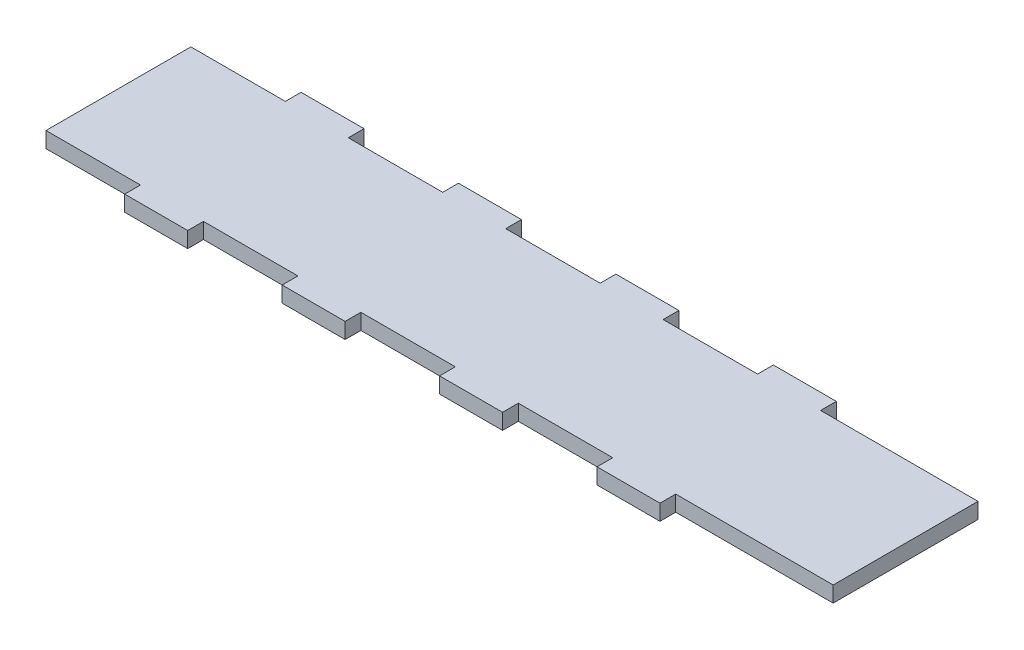
ISO-10303-21;
HEADER;
FILE_DESCRIPTION(('STEP AP214'),'2;1');
FILE_NAME('part.step','',(''),(''),'','','');
FILE_SCHEMA(('AUTOMOTIVE_DESIGN { 1 0 10303 214 1 1 1 1 }'));
ENDSEC;
DATA;
#1=APPLICATION_CONTEXT('core data for automotive mechanical design processes');
#2=APPLICATION_PROTOCOL_DEFINITION('international standard','automotive_design',2000,#1);
#3=PRODUCT_CONTEXT('',#1,'mechanical');
#4=PRODUCT('Part','Part','',(#3));
#5=PRODUCT_RELATED_PRODUCT_CATEGORY('part','',(#4));
#6=PRODUCT_DEFINITION_FORMATION('','',#4);
#7=PRODUCT_DEFINITION_CONTEXT('part definition',#1,'design');
#8=PRODUCT_DEFINITION('design','',#6,#7);
#9=PRODUCT_DEFINITION_SHAPE('','',#8);
#10=(LENGTH_UNIT() NAMED_UNIT(*) SI_UNIT(.MILLI.,.METRE.));
#11=(NAMED_UNIT(*) PLANE_ANGLE_UNIT() SI_UNIT($,.RADIAN.));
#12=(NAMED_UNIT(*) SI_UNIT($,.STERADIAN.) SOLID_ANGLE_UNIT());
#13=UNCERTAINTY_MEASURE_WITH_UNIT(LENGTH_MEASURE(1.E-05),#10,'distance_accuracy_value','');
#14=(GEOMETRIC_REPRESENTATION_CONTEXT(3) GLOBAL_UNCERTAINTY_ASSIGNED_CONTEXT((#13)) GLOBAL_UNIT_ASSIGNED_CONTEXT((#10,
#11,#12)) REPRESENTATION_CONTEXT('',''));
#15=CARTESIAN_POINT('',(0.,0.,0.));
#16=DIRECTION('',(0.,0.,1.));
#17=DIRECTION('',(1.,0.,0.));
#18=AXIS2_PLACEMENT_3D('',#15,#16,#17);
#19=CARTESIAN_POINT('',(-79.375,3.175,-17.78));
#20=DIRECTION('',(0.,0.,1.));
#21=DIRECTION('',(1.,0.,0.));
#22=AXIS2_PLACEMENT_3D('',#19,#20,#21);
#23=PLANE('',#22);
#24=DIRECTION('',(-1.,0.,0.));
#25=VECTOR('',#24,1.);
#26=CARTESIAN_POINT('',(-79.375,3.175,-17.78));
#27=LINE('',#26,#25);
#28=CARTESIAN_POINT('',(15.875,3.175,-17.78));
#29=VERTEX_POINT('',#28);
#30=CARTESIAN_POINT('',(3.175,3.175,-17.78));
#31=VERTEX_POINT('',#30);
#32=EDGE_CURVE('E41',#29,#31,#27,.T.);
#33=ORIENTED_EDGE('',*,*,#32,.F.);
#34=DIRECTION('',(0.,1.,0.));
#35=VECTOR('',#34,1.);
#36=CARTESIAN_POINT('',(15.875,0.,-17.78));
#37=LINE('',#36,#35);
#38=CARTESIAN_POINT('',(15.875,0.,-17.78));
#39=VERTEX_POINT('',#38);
#40=EDGE_CURVE('E297',#39,#29,#37,.T.);
#41=ORIENTED_EDGE('',*,*,#40,.F.);
#42=DIRECTION('',(-1.,0.,0.));
#43=VECTOR('',#42,1.);
#44=CARTESIAN_POINT('',(-79.375,0.,-17.78));
#45=LINE('',#44,#43);
#46=CARTESIAN_POINT('',(3.175,0.,-17.78));
#47=VERTEX_POINT('',#46);
#48=EDGE_CURVE('E288',#39,#47,#45,.T.);
#49=ORIENTED_EDGE('',*,*,#48,.T.);
#50=DIRECTION('',(0.,1.,0.));
#51=VECTOR('',#50,1.);
#52=CARTESIAN_POINT('',(3.175,0.,-17.78));
#53=LINE('',#52,#51);
#54=EDGE_CURVE('E323',#47,#31,#53,.T.);
#55=ORIENTED_EDGE('',*,*,#54,.T.);
#56=EDGE_LOOP('',(#33,#41,#49,#55));
#57=FACE_BOUND('',#56,.T.);
#58=ADVANCED_FACE('F32',(#57),#23,.F.);
#59=CARTESIAN_POINT('',(-15.875,3.175,-17.78));
#60=VERTEX_POINT('',#59);
#61=CARTESIAN_POINT('',(-28.575,3.175,-17.78));
#62=VERTEX_POINT('',#61);
#63=EDGE_CURVE('E552',#60,#62,#27,.T.);
#64=ORIENTED_EDGE('',*,*,#63,.F.);
#65=DIRECTION('',(0.,1.,0.));
#66=VECTOR('',#65,1.);
#67=CARTESIAN_POINT('',(-15.875,0.,-17.78));
#68=LINE('',#67,#66);
#69=CARTESIAN_POINT('',(-15.875,0.,-17.78));
#70=VERTEX_POINT('',#69);
#71=EDGE_CURVE('E320',#70,#60,#68,.T.);
#72=ORIENTED_EDGE('',*,*,#71,.F.);
#73=CARTESIAN_POINT('',(-28.575,0.,-17.78));
#74=VERTEX_POINT('',#73);
#75=EDGE_CURVE('E531',#70,#74,#45,.T.);
#76=ORIENTED_EDGE('',*,*,#75,.T.);
#77=DIRECTION('',(0.,1.,0.));
#78=VECTOR('',#77,1.);
#79=CARTESIAN_POINT('',(-28.575,0.,-17.78));
#80=LINE('',#79,#78);
#81=EDGE_CURVE('E350',#74,#62,#80,.T.);
#82=ORIENTED_EDGE('',*,*,#81,.T.);
#83=EDGE_LOOP('',(#64,#72,#76,#82));
#84=FACE_BOUND('',#83,.T.);
#85=ADVANCED_FACE('F566',(#84),#23,.F.);
#86=CARTESIAN_POINT('',(-47.625,3.175,-17.78));
#87=VERTEX_POINT('',#86);
#88=CARTESIAN_POINT('',(-60.325,3.175,-17.78));
#89=VERTEX_POINT('',#88);
#90=EDGE_CURVE('E43',#87,#89,#27,.T.);
#91=ORIENTED_EDGE('',*,*,#90,.F.);
#92=DIRECTION('',(0.,1.,0.));
#93=VECTOR('',#92,1.);
#94=CARTESIAN_POINT('',(-47.625,0.,-17.78));
#95=LINE('',#94,#93);
#96=CARTESIAN_POINT('',(-47.625,0.,-17.78));
#97=VERTEX_POINT('',#96);
#98=EDGE_CURVE('E347',#97,#87,#95,.T.);
#99=ORIENTED_EDGE('',*,*,#98,.F.);
#100=CARTESIAN_POINT('',(-60.325,0.,-17.78));
#101=VERTEX_POINT('',#100);
#102=EDGE_CURVE('E527',#97,#101,#45,.T.);
#103=ORIENTED_EDGE('',*,*,#102,.T.);
#104=DIRECTION('',(0.,1.,0.));
#105=VECTOR('',#104,1.);
#106=CARTESIAN_POINT('',(-60.325,0.,-17.78));
#107=LINE('',#106,#105);
#108=EDGE_CURVE('E476',#101,#89,#107,.T.);
#109=ORIENTED_EDGE('',*,*,#108,.T.);
#110=EDGE_LOOP('',(#91,#99,#103,#109));
#111=FACE_BOUND('',#110,.T.);
#112=ADVANCED_FACE('F563',(#111),#23,.F.);
#113=CARTESIAN_POINT('',(-79.375,3.175,17.78));
#114=DIRECTION('',(0.,0.,-1.));
#115=DIRECTION('',(-1.,0.,0.));
#116=AXIS2_PLACEMENT_3D('',#113,#114,#115);
#117=PLANE('',#116);
#118=DIRECTION('',(1.,0.,0.));
#119=VECTOR('',#118,1.);
#120=CARTESIAN_POINT('',(-79.375,3.175,17.78));
#121=LINE('',#120,#119);
#122=CARTESIAN_POINT('',(-60.325,3.175,17.78));
#123=VERTEX_POINT('',#122);
#124=CARTESIAN_POINT('',(-47.625,3.175,17.78));
#125=VERTEX_POINT('',#124);
#126=EDGE_CURVE('E514',#123,#125,#121,.T.);
#127=ORIENTED_EDGE('',*,*,#126,.F.);
#128=DIRECTION('',(0.,1.,0.));
#129=VECTOR('',#128,1.);
#130=CARTESIAN_POINT('',(-60.325,0.,17.78));
#131=LINE('',#130,#129);
#132=CARTESIAN_POINT('',(-60.325,0.,17.78));
#133=VERTEX_POINT('',#132);
#134=EDGE_CURVE('E363',#133,#123,#131,.T.);
#135=ORIENTED_EDGE('',*,*,#134,.F.);
#136=DIRECTION('',(1.,0.,0.));
#137=VECTOR('',#136,1.);
#138=CARTESIAN_POINT('',(-79.375,0.,17.78));
#139=LINE('',#138,#137);
#140=CARTESIAN_POINT('',(-47.625,0.,17.78));
#141=VERTEX_POINT('',#140);
#142=EDGE_CURVE('E523',#133,#141,#139,.T.);
#143=ORIENTED_EDGE('',*,*,#142,.T.);
#144=DIRECTION('',(0.,1.,0.));
#145=VECTOR('',#144,1.);
#146=CARTESIAN_POINT('',(-47.625,0.,17.78));
#147=LINE('',#146,#145);
#148=EDGE_CURVE('E392',#141,#125,#147,.T.);
#149=ORIENTED_EDGE('',*,*,#148,.T.);
#150=EDGE_LOOP('',(#127,#135,#143,#149));
#151=FACE_BOUND('',#150,.T.);
#152=ADVANCED_FACE('F565',(#151),#117,.F.);
#153=CARTESIAN_POINT('',(-28.575,3.175,17.78));
#154=VERTEX_POINT('',#153);
#155=CARTESIAN_POINT('',(-15.8750000000001,3.175,17.78));
#156=VERTEX_POINT('',#155);
#157=EDGE_CURVE('E517',#154,#156,#121,.T.);
#158=ORIENTED_EDGE('',*,*,#157,.F.);
#159=DIRECTION('',(0.,1.,0.));
#160=VECTOR('',#159,1.);
#161=CARTESIAN_POINT('',(-28.575,0.,17.78));
#162=LINE('',#161,#160);
#163=CARTESIAN_POINT('',(-28.575,0.,17.78));
#164=VERTEX_POINT('',#163);
#165=EDGE_CURVE('E384',#164,#154,#162,.T.);
#166=ORIENTED_EDGE('',*,*,#165,.F.);
#167=CARTESIAN_POINT('',(-15.8750000000001,0.,17.78));
#168=VERTEX_POINT('',#167);
#169=EDGE_CURVE('E525',#164,#168,#139,.T.);
#170=ORIENTED_EDGE('',*,*,#169,.T.);
#171=DIRECTION('',(0.,1.,0.));
#172=VECTOR('',#171,1.);
#173=CARTESIAN_POINT('',(-15.8750000000001,0.,17.78));
#174=LINE('',#173,#172);
#175=EDGE_CURVE('E419',#168,#156,#174,.T.);
#176=ORIENTED_EDGE('',*,*,#175,.T.);
#177=EDGE_LOOP('',(#158,#166,#170,#176));
#178=FACE_BOUND('',#177,.T.);
#179=ADVANCED_FACE('F573',(#178),#117,.F.);
#180=CARTESIAN_POINT('',(3.17499999999994,3.175,17.78));
#181=VERTEX_POINT('',#180);
#182=CARTESIAN_POINT('',(15.8749999999999,3.175,17.78));
#183=VERTEX_POINT('',#182);
#184=EDGE_CURVE('E944',#181,#183,#121,.T.);
#185=ORIENTED_EDGE('',*,*,#184,.F.);
#186=DIRECTION('',(0.,1.,0.));
#187=VECTOR('',#186,1.);
#188=CARTESIAN_POINT('',(3.17499999999994,0.,17.78));
#189=LINE('',#188,#187);
#190=CARTESIAN_POINT('',(3.17499999999994,0.,17.78));
#191=VERTEX_POINT('',#190);
#192=EDGE_CURVE('E411',#191,#181,#189,.T.);
#193=ORIENTED_EDGE('',*,*,#192,.F.);
#194=CARTESIAN_POINT('',(15.8749999999999,0.,17.78));
#195=VERTEX_POINT('',#194);
#196=EDGE_CURVE('E928',#191,#195,#139,.T.);
#197=ORIENTED_EDGE('',*,*,#196,.T.);
#198=DIRECTION('',(0.,1.,0.));
#199=VECTOR('',#198,1.);
#200=CARTESIAN_POINT('',(15.8749999999999,0.,17.78));
#201=LINE('',#200,#199);
#202=EDGE_CURVE('E501',#195,#183,#201,.T.);
#203=ORIENTED_EDGE('',*,*,#202,.T.);
#204=EDGE_LOOP('',(#185,#193,#197,#203));
#205=FACE_BOUND('',#204,.T.);
#206=ADVANCED_FACE('F607',(#205),#117,.F.);
#207=CARTESIAN_POINT('',(-79.375,3.175,-17.78));
#208=DIRECTION('',(1.,0.,0.));
#209=DIRECTION('',(0.,0.,-1.));
#210=AXIS2_PLACEMENT_3D('',#207,#208,#209);
#211=PLANE('',#210);
#212=DIRECTION('',(0.,0.,1.));
#213=VECTOR('',#212,1.);
#214=CARTESIAN_POINT('',(-79.375,0.,-17.78));
#215=LINE('',#214,#213);
#216=CARTESIAN_POINT('',(-79.375,0.,-14.605));
#217=VERTEX_POINT('',#216);
#218=CARTESIAN_POINT('',(-79.375,0.,14.605));
#219=VERTEX_POINT('',#218);
#220=EDGE_CURVE('E504',#217,#219,#215,.T.);
#221=ORIENTED_EDGE('',*,*,#220,.T.);
#222=DIRECTION('',(0.,1.,0.));
#223=VECTOR('',#222,1.);
#224=CARTESIAN_POINT('',(-79.375,0.,14.605));
#225=LINE('',#224,#223);
#226=CARTESIAN_POINT('',(-79.375,3.175,14.605));
#227=VERTEX_POINT('',#226);
#228=EDGE_CURVE('E367',#219,#227,#225,.T.);
#229=ORIENTED_EDGE('',*,*,#228,.T.);
#230=DIRECTION('',(0.,0.,1.));
#231=VECTOR('',#230,1.);
#232=CARTESIAN_POINT('',(-79.375,3.175,-17.78));
#233=LINE('',#232,#231);
#234=CARTESIAN_POINT('',(-79.375,3.175,-14.605));
#235=VERTEX_POINT('',#234);
#236=EDGE_CURVE('E510',#235,#227,#233,.T.);
#237=ORIENTED_EDGE('',*,*,#236,.F.);
#238=DIRECTION('',(0.,1.,0.));
#239=VECTOR('',#238,1.);
#240=CARTESIAN_POINT('',(-79.375,0.,-14.605));
#241=LINE('',#240,#239);
#242=EDGE_CURVE('E471',#217,#235,#241,.T.);
#243=ORIENTED_EDGE('',*,*,#242,.F.);
#244=EDGE_LOOP('',(#221,#229,#237,#243));
#245=FACE_BOUND('',#244,.T.);
#246=ADVANCED_FACE('F34',(#245),#211,.F.);
#247=CARTESIAN_POINT('',(34.9249999999999,0.,17.78));
#248=VERTEX_POINT('',#247);
#249=CARTESIAN_POINT('',(47.6249999999999,0.,17.78));
#250=VERTEX_POINT('',#249);
#251=EDGE_CURVE('E522',#248,#250,#139,.T.);
#252=ORIENTED_EDGE('',*,*,#251,.T.);
#253=DIRECTION('',(0.,1.,0.));
#254=VECTOR('',#253,1.);
#255=CARTESIAN_POINT('',(47.6249999999999,0.,17.78));
#256=LINE('',#255,#254);
#257=CARTESIAN_POINT('',(47.6249999999999,3.175,17.78));
#258=VERTEX_POINT('',#257);
#259=EDGE_CURVE('E457',#250,#258,#256,.T.);
#260=ORIENTED_EDGE('',*,*,#259,.T.);
#261=CARTESIAN_POINT('',(34.9249999999999,3.175,17.78));
#262=VERTEX_POINT('',#261);
#263=EDGE_CURVE('E513',#262,#258,#121,.T.);
#264=ORIENTED_EDGE('',*,*,#263,.F.);
#265=DIRECTION('',(0.,1.,0.));
#266=VECTOR('',#265,1.);
#267=CARTESIAN_POINT('',(34.9249999999999,0.,17.78));
#268=LINE('',#267,#266);
#269=EDGE_CURVE('E493',#248,#262,#268,.T.);
#270=ORIENTED_EDGE('',*,*,#269,.F.);
#271=EDGE_LOOP('',(#252,#260,#264,#270));
#272=FACE_BOUND('',#271,.T.);
#273=ADVANCED_FACE('F575',(#272),#117,.F.);
#274=CARTESIAN_POINT('',(79.375,3.175,-17.78));
#275=DIRECTION('',(-1.,0.,0.));
#276=DIRECTION('',(0.,0.,1.));
#277=AXIS2_PLACEMENT_3D('',#274,#275,#276);
#278=PLANE('',#277);
#279=DIRECTION('',(0.,0.,-1.));
#280=VECTOR('',#279,1.);
#281=CARTESIAN_POINT('',(79.375,0.,-17.78));
#282=LINE('',#281,#280);
#283=CARTESIAN_POINT('',(79.375,0.,14.605));
#284=VERTEX_POINT('',#283);
#285=CARTESIAN_POINT('',(79.375,0.,-14.605));
#286=VERTEX_POINT('',#285);
#287=EDGE_CURVE('E524',#284,#286,#282,.T.);
#288=ORIENTED_EDGE('',*,*,#287,.T.);
#289=DIRECTION('',(0.,1.,0.));
#290=VECTOR('',#289,1.);
#291=CARTESIAN_POINT('',(79.375,0.,-14.605));
#292=LINE('',#291,#290);
#293=CARTESIAN_POINT('',(79.375,3.175,-14.605));
#294=VERTEX_POINT('',#293);
#295=EDGE_CURVE('E439',#286,#294,#292,.T.);
#296=ORIENTED_EDGE('',*,*,#295,.T.);
#297=DIRECTION('',(0.,0.,-1.));
#298=VECTOR('',#297,1.);
#299=CARTESIAN_POINT('',(79.375,3.175,-17.78));
#300=LINE('',#299,#298);
#301=CARTESIAN_POINT('',(79.375,3.175,14.605));
#302=VERTEX_POINT('',#301);
#303=EDGE_CURVE('E516',#302,#294,#300,.T.);
#304=ORIENTED_EDGE('',*,*,#303,.F.);
#305=DIRECTION('',(0.,1.,0.));
#306=VECTOR('',#305,1.);
#307=CARTESIAN_POINT('',(79.375,0.,14.605));
#308=LINE('',#307,#306);
#309=EDGE_CURVE('E453',#284,#302,#308,.T.);
#310=ORIENTED_EDGE('',*,*,#309,.F.);
#311=EDGE_LOOP('',(#288,#296,#304,#310));
#312=FACE_BOUND('',#311,.T.);
#313=ADVANCED_FACE('F580',(#312),#278,.F.);
#314=CARTESIAN_POINT('',(47.625,0.,-17.78));
#315=VERTEX_POINT('',#314);
#316=CARTESIAN_POINT('',(34.925,0.,-17.78));
#317=VERTEX_POINT('',#316);
#318=EDGE_CURVE('E36',#315,#317,#45,.T.);
#319=ORIENTED_EDGE('',*,*,#318,.T.);
#320=DIRECTION('',(0.,1.,0.));
#321=VECTOR('',#320,1.);
#322=CARTESIAN_POINT('',(34.925,0.,-17.78));
#323=LINE('',#322,#321);
#324=CARTESIAN_POINT('',(34.925,3.175,-17.78));
#325=VERTEX_POINT('',#324);
#326=EDGE_CURVE('E300',#317,#325,#323,.T.);
#327=ORIENTED_EDGE('',*,*,#326,.T.);
#328=CARTESIAN_POINT('',(47.625,3.175,-17.78));
#329=VERTEX_POINT('',#328);
#330=EDGE_CURVE('E11',#329,#325,#27,.T.);
#331=ORIENTED_EDGE('',*,*,#330,.F.);
#332=DIRECTION('',(0.,1.,0.));
#333=VECTOR('',#332,1.);
#334=CARTESIAN_POINT('',(47.625,0.,-17.78));
#335=LINE('',#334,#333);
#336=EDGE_CURVE('E435',#315,#329,#335,.T.);
#337=ORIENTED_EDGE('',*,*,#336,.F.);
#338=EDGE_LOOP('',(#319,#327,#331,#337));
#339=FACE_BOUND('',#338,.T.);
#340=ADVANCED_FACE('F568',(#339),#23,.F.);
#341=CARTESIAN_POINT('',(-79.375,3.175,17.78));
#342=DIRECTION('',(0.,1.,0.));
#343=DIRECTION('',(0.,0.,1.));
#344=AXIS2_PLACEMENT_3D('',#341,#342,#343);
#345=PLANE('',#344);
#346=DIRECTION('',(0.,0.,1.));
#347=VECTOR('',#346,1.);
#348=CARTESIAN_POINT('',(15.875,3.175,-17.78));
#349=LINE('',#348,#347);
#350=CARTESIAN_POINT('',(15.875,3.175,-14.605));
#351=VERTEX_POINT('',#350);
#352=EDGE_CURVE('E275',#29,#351,#349,.T.);
#353=ORIENTED_EDGE('',*,*,#352,.F.);
#354=ORIENTED_EDGE('',*,*,#32,.T.);
#355=DIRECTION('',(0.,0.,-1.));
#356=VECTOR('',#355,1.);
#357=CARTESIAN_POINT('',(3.175,3.175,-17.78));
#358=LINE('',#357,#356);
#359=CARTESIAN_POINT('',(3.175,3.175,-14.605));
#360=VERTEX_POINT('',#359);
#361=EDGE_CURVE('E308',#360,#31,#358,.T.);
#362=ORIENTED_EDGE('',*,*,#361,.F.);
#363=DIRECTION('',(1.,0.,0.));
#364=VECTOR('',#363,1.);
#365=CARTESIAN_POINT('',(-15.875,3.175,-14.605));
#366=LINE('',#365,#364);
#367=CARTESIAN_POINT('',(-15.875,3.175,-14.605));
#368=VERTEX_POINT('',#367);
#369=EDGE_CURVE('E315',#368,#360,#366,.T.);
#370=ORIENTED_EDGE('',*,*,#369,.F.);
#371=DIRECTION('',(0.,0.,1.));
#372=VECTOR('',#371,1.);
#373=CARTESIAN_POINT('',(-15.875,3.175,-17.78));
#374=LINE('',#373,#372);
#375=EDGE_CURVE('E299',#60,#368,#374,.T.);
#376=ORIENTED_EDGE('',*,*,#375,.F.);
#377=ORIENTED_EDGE('',*,*,#63,.T.);
#378=DIRECTION('',(0.,0.,-1.));
#379=VECTOR('',#378,1.);
#380=CARTESIAN_POINT('',(-28.575,3.175,-17.78));
#381=LINE('',#380,#379);
#382=CARTESIAN_POINT('',(-28.575,3.175,-14.605));
#383=VERTEX_POINT('',#382);
#384=EDGE_CURVE('E333',#383,#62,#381,.T.);
#385=ORIENTED_EDGE('',*,*,#384,.F.);
#386=DIRECTION('',(1.,0.,0.));
#387=VECTOR('',#386,1.);
#388=CARTESIAN_POINT('',(-47.625,3.175,-14.605));
#389=LINE('',#388,#387);
#390=CARTESIAN_POINT('',(-47.625,3.175,-14.605));
#391=VERTEX_POINT('',#390);
#392=EDGE_CURVE('E342',#391,#383,#389,.T.);
#393=ORIENTED_EDGE('',*,*,#392,.F.);
#394=DIRECTION('',(0.,0.,1.));
#395=VECTOR('',#394,1.);
#396=CARTESIAN_POINT('',(-47.625,3.175,-17.78));
#397=LINE('',#396,#395);
#398=EDGE_CURVE('E322',#87,#391,#397,.T.);
#399=ORIENTED_EDGE('',*,*,#398,.F.);
#400=ORIENTED_EDGE('',*,*,#90,.T.);
#401=DIRECTION('',(0.,0.,-1.));
#402=VECTOR('',#401,1.);
#403=CARTESIAN_POINT('',(-60.325,3.175,-17.78));
#404=LINE('',#403,#402);
#405=CARTESIAN_POINT('',(-60.325,3.175,-14.605));
#406=VERTEX_POINT('',#405);
#407=EDGE_CURVE('E468',#406,#89,#404,.T.);
#408=ORIENTED_EDGE('',*,*,#407,.F.);
#409=DIRECTION('',(1.,0.,0.));
#410=VECTOR('',#409,1.);
#411=CARTESIAN_POINT('',(-79.375,3.175,-14.605));
#412=LINE('',#411,#410);
#413=EDGE_CURVE('E460',#235,#406,#412,.T.);
#414=ORIENTED_EDGE('',*,*,#413,.F.);
#415=ORIENTED_EDGE('',*,*,#236,.T.);
#416=DIRECTION('',(-1.,0.,0.));
#417=VECTOR('',#416,1.);
#418=CARTESIAN_POINT('',(-79.375,3.175,14.605));
#419=LINE('',#418,#417);
#420=CARTESIAN_POINT('',(-60.325,3.175,14.605));
#421=VERTEX_POINT('',#420);
#422=EDGE_CURVE('E360',#421,#227,#419,.T.);
#423=ORIENTED_EDGE('',*,*,#422,.F.);
#424=DIRECTION('',(0.,0.,-1.));
#425=VECTOR('',#424,1.);
#426=CARTESIAN_POINT('',(-60.325,3.175,17.78));
#427=LINE('',#426,#425);
#428=EDGE_CURVE('E349',#123,#421,#427,.T.);
#429=ORIENTED_EDGE('',*,*,#428,.F.);
#430=ORIENTED_EDGE('',*,*,#126,.T.);
#431=DIRECTION('',(0.,0.,1.));
#432=VECTOR('',#431,1.);
#433=CARTESIAN_POINT('',(-47.625,3.175,17.78));
#434=LINE('',#433,#432);
#435=CARTESIAN_POINT('',(-47.625,3.175,14.605));
#436=VERTEX_POINT('',#435);
#437=EDGE_CURVE('E378',#436,#125,#434,.T.);
#438=ORIENTED_EDGE('',*,*,#437,.F.);
#439=DIRECTION('',(-1.,0.,0.));
#440=VECTOR('',#439,1.);
#441=CARTESIAN_POINT('',(-47.625,3.175,14.605));
#442=LINE('',#441,#440);
#443=CARTESIAN_POINT('',(-28.575,3.175,14.605));
#444=VERTEX_POINT('',#443);
#445=EDGE_CURVE('E387',#444,#436,#442,.T.);
#446=ORIENTED_EDGE('',*,*,#445,.F.);
#447=DIRECTION('',(0.,0.,-1.));
#448=VECTOR('',#447,1.);
#449=CARTESIAN_POINT('',(-28.575,3.175,17.78));
#450=LINE('',#449,#448);
#451=EDGE_CURVE('E370',#154,#444,#450,.T.);
#452=ORIENTED_EDGE('',*,*,#451,.F.);
#453=ORIENTED_EDGE('',*,*,#157,.T.);
#454=DIRECTION('',(0.,0.,1.));
#455=VECTOR('',#454,1.);
#456=CARTESIAN_POINT('',(-15.8750000000001,3.175,17.78));
#457=LINE('',#456,#455);
#458=CARTESIAN_POINT('',(-15.8750000000001,3.175,14.605));
#459=VERTEX_POINT('',#458);
#460=EDGE_CURVE('E405',#459,#156,#457,.T.);
#461=ORIENTED_EDGE('',*,*,#460,.F.);
#462=DIRECTION('',(-1.,0.,0.));
#463=VECTOR('',#462,1.);
#464=CARTESIAN_POINT('',(-15.8750000000001,3.175,14.605));
#465=LINE('',#464,#463);
#466=CARTESIAN_POINT('',(3.17499999999994,3.175,14.605));
#467=VERTEX_POINT('',#466);
#468=EDGE_CURVE('E414',#467,#459,#465,.T.);
#469=ORIENTED_EDGE('',*,*,#468,.F.);
#470=DIRECTION('',(0.,0.,-1.));
#471=VECTOR('',#470,1.);
#472=CARTESIAN_POINT('',(3.17499999999994,3.175,17.78));
#473=LINE('',#472,#471);
#474=EDGE_CURVE('E395',#181,#467,#473,.T.);
#475=ORIENTED_EDGE('',*,*,#474,.F.);
#476=ORIENTED_EDGE('',*,*,#184,.T.);
#477=DIRECTION('',(0.,0.,1.));
#478=VECTOR('',#477,1.);
#479=CARTESIAN_POINT('',(15.8749999999999,3.175,17.78));
#480=LINE('',#479,#478);
#481=CARTESIAN_POINT('',(15.8749999999999,3.175,14.605));
#482=VERTEX_POINT('',#481);
#483=EDGE_CURVE('E487',#482,#183,#480,.T.);
#484=ORIENTED_EDGE('',*,*,#483,.F.);
#485=DIRECTION('',(-1.,0.,0.));
#486=VECTOR('',#485,1.);
#487=CARTESIAN_POINT('',(15.8749999999999,3.175,14.605));
#488=LINE('',#487,#486);
#489=CARTESIAN_POINT('',(34.9249999999999,3.175,14.605));
#490=VERTEX_POINT('',#489);
#491=EDGE_CURVE('E496',#490,#482,#488,.T.);
#492=ORIENTED_EDGE('',*,*,#491,.F.);
#493=DIRECTION('',(0.,0.,-1.));
#494=VECTOR('',#493,1.);
#495=CARTESIAN_POINT('',(34.9249999999999,3.175,14.605));
#496=LINE('',#495,#494);
#497=EDGE_CURVE('E479',#262,#490,#496,.T.);
#498=ORIENTED_EDGE('',*,*,#497,.F.);
#499=ORIENTED_EDGE('',*,*,#263,.T.);
#500=DIRECTION('',(0.,0.,1.));
#501=VECTOR('',#500,1.);
#502=CARTESIAN_POINT('',(47.6249999999999,3.175,17.78));
#503=LINE('',#502,#501);
#504=CARTESIAN_POINT('',(47.6249999999999,3.175,14.605));
#505=VERTEX_POINT('',#504);
#506=EDGE_CURVE('E450',#505,#258,#503,.T.);
#507=ORIENTED_EDGE('',*,*,#506,.F.);
#508=DIRECTION('',(-1.,0.,0.));
#509=VECTOR('',#508,1.);
#510=CARTESIAN_POINT('',(47.6249999999999,3.175,14.605));
#511=LINE('',#510,#509);
#512=EDGE_CURVE('E442',#302,#505,#511,.T.);
#513=ORIENTED_EDGE('',*,*,#512,.F.);
#514=ORIENTED_EDGE('',*,*,#303,.T.);
#515=DIRECTION('',(1.,0.,0.));
#516=VECTOR('',#515,1.);
#517=CARTESIAN_POINT('',(79.375,3.175,-14.605));
#518=LINE('',#517,#516);
#519=CARTESIAN_POINT('',(47.625,3.175,-14.605));
#520=VERTEX_POINT('',#519);
#521=EDGE_CURVE('E432',#520,#294,#518,.T.);
#522=ORIENTED_EDGE('',*,*,#521,.F.);
#523=DIRECTION('',(0.,0.,1.));
#524=VECTOR('',#523,1.);
#525=CARTESIAN_POINT('',(47.625,3.175,-17.78));
#526=LINE('',#525,#524);
#527=EDGE_CURVE('E422',#329,#520,#526,.T.);
#528=ORIENTED_EDGE('',*,*,#527,.F.);
#529=ORIENTED_EDGE('',*,*,#330,.T.);
#530=DIRECTION('',(0.,0.,-1.));
#531=VECTOR('',#530,1.);
#532=CARTESIAN_POINT('',(34.925,3.175,-17.78));
#533=LINE('',#532,#531);
#534=CARTESIAN_POINT('',(34.925,3.175,-14.605));
#535=VERTEX_POINT('',#534);
#536=EDGE_CURVE('E289',#535,#325,#533,.T.);
#537=ORIENTED_EDGE('',*,*,#536,.F.);
#538=DIRECTION('',(1.,0.,0.));
#539=VECTOR('',#538,1.);
#540=CARTESIAN_POINT('',(15.875,3.175,-14.605));
#541=LINE('',#540,#539);
#542=EDGE_CURVE('E291',#351,#535,#541,.T.);
#543=ORIENTED_EDGE('',*,*,#542,.F.);
#544=EDGE_LOOP('',(#353,#354,#362,#370,#376,#377,#385,#393,#399,#400,#408,#414,#415,#423,#429,
#430,#438,#446,#452,#453,#461,#469,#475,#476,#484,#492,#498,#499,#507,#513,#514,#522,#528,#529,
#537,#543));
#545=FACE_BOUND('',#544,.T.);
#546=ADVANCED_FACE('F551',(#545),#345,.T.);
#547=CARTESIAN_POINT('',(-79.375,0.,17.78));
#548=DIRECTION('',(0.,1.,0.));
#549=DIRECTION('',(0.,0.,1.));
#550=AXIS2_PLACEMENT_3D('',#547,#548,#549);
#551=PLANE('',#550);
#552=ORIENTED_EDGE('',*,*,#48,.F.);
#553=DIRECTION('',(0.,0.,1.));
#554=VECTOR('',#553,1.);
#555=CARTESIAN_POINT('',(15.875,0.,-17.78));
#556=LINE('',#555,#554);
#557=CARTESIAN_POINT('',(15.875,0.,-14.605));
#558=VERTEX_POINT('',#557);
#559=EDGE_CURVE('E272',#39,#558,#556,.T.);
#560=ORIENTED_EDGE('',*,*,#559,.T.);
#561=DIRECTION('',(1.,0.,0.));
#562=VECTOR('',#561,1.);
#563=CARTESIAN_POINT('',(15.875,0.,-14.605));
#564=LINE('',#563,#562);
#565=CARTESIAN_POINT('',(34.925,0.,-14.605));
#566=VERTEX_POINT('',#565);
#567=EDGE_CURVE('E282',#558,#566,#564,.T.);
#568=ORIENTED_EDGE('',*,*,#567,.T.);
#569=DIRECTION('',(0.,0.,-1.));
#570=VECTOR('',#569,1.);
#571=CARTESIAN_POINT('',(34.925,0.,-17.78));
#572=LINE('',#571,#570);
#573=EDGE_CURVE('E50',#566,#317,#572,.T.);
#574=ORIENTED_EDGE('',*,*,#573,.T.);
#575=ORIENTED_EDGE('',*,*,#318,.F.);
#576=DIRECTION('',(0.,0.,1.));
#577=VECTOR('',#576,1.);
#578=CARTESIAN_POINT('',(47.625,0.,-17.78));
#579=LINE('',#578,#577);
#580=CARTESIAN_POINT('',(47.625,0.,-14.605));
#581=VERTEX_POINT('',#580);
#582=EDGE_CURVE('E428',#315,#581,#579,.T.);
#583=ORIENTED_EDGE('',*,*,#582,.T.);
#584=DIRECTION('',(1.,0.,0.));
#585=VECTOR('',#584,1.);
#586=CARTESIAN_POINT('',(47.625,0.,-14.605));
#587=LINE('',#586,#585);
#588=EDGE_CURVE('E431',#581,#286,#587,.T.);
#589=ORIENTED_EDGE('',*,*,#588,.T.);
#590=ORIENTED_EDGE('',*,*,#287,.F.);
#591=DIRECTION('',(-1.,0.,0.));
#592=VECTOR('',#591,1.);
#593=CARTESIAN_POINT('',(66.6749999999999,0.,14.605));
#594=LINE('',#593,#592);
#595=CARTESIAN_POINT('',(47.6249999999999,0.,14.605));
#596=VERTEX_POINT('',#595);
#597=EDGE_CURVE('E446',#284,#596,#594,.T.);
#598=ORIENTED_EDGE('',*,*,#597,.T.);
#599=DIRECTION('',(0.,0.,1.));
#600=VECTOR('',#599,1.);
#601=CARTESIAN_POINT('',(47.6249999999999,0.,17.78));
#602=LINE('',#601,#600);
#603=EDGE_CURVE('E449',#596,#250,#602,.T.);
#604=ORIENTED_EDGE('',*,*,#603,.T.);
#605=ORIENTED_EDGE('',*,*,#251,.F.);
#606=DIRECTION('',(0.,0.,-1.));
#607=VECTOR('',#606,1.);
#608=CARTESIAN_POINT('',(34.9249999999999,0.,14.605));
#609=LINE('',#608,#607);
#610=CARTESIAN_POINT('',(34.9249999999999,0.,14.605));
#611=VERTEX_POINT('',#610);
#612=EDGE_CURVE('E483',#248,#611,#609,.T.);
#613=ORIENTED_EDGE('',*,*,#612,.T.);
#614=DIRECTION('',(-1.,0.,0.));
#615=VECTOR('',#614,1.);
#616=CARTESIAN_POINT('',(15.8749999999999,0.,14.605));
#617=LINE('',#616,#615);
#618=CARTESIAN_POINT('',(15.8749999999999,0.,14.605));
#619=VERTEX_POINT('',#618);
#620=EDGE_CURVE('E486',#611,#619,#617,.T.);
#621=ORIENTED_EDGE('',*,*,#620,.T.);
#622=DIRECTION('',(0.,0.,1.));
#623=VECTOR('',#622,1.);
#624=CARTESIAN_POINT('',(15.8749999999999,0.,17.78));
#625=LINE('',#624,#623);
#626=EDGE_CURVE('E490',#619,#195,#625,.T.);
#627=ORIENTED_EDGE('',*,*,#626,.T.);
#628=ORIENTED_EDGE('',*,*,#196,.F.);
#629=DIRECTION('',(0.,0.,-1.));
#630=VECTOR('',#629,1.);
#631=CARTESIAN_POINT('',(3.17499999999994,0.,17.78));
#632=LINE('',#631,#630);
#633=CARTESIAN_POINT('',(3.17499999999994,0.,14.605));
#634=VERTEX_POINT('',#633);
#635=EDGE_CURVE('E401',#191,#634,#632,.T.);
#636=ORIENTED_EDGE('',*,*,#635,.T.);
#637=DIRECTION('',(-1.,0.,0.));
#638=VECTOR('',#637,1.);
#639=CARTESIAN_POINT('',(-15.8750000000001,0.,14.605));
#640=LINE('',#639,#638);
#641=CARTESIAN_POINT('',(-15.8750000000001,0.,14.605));
#642=VERTEX_POINT('',#641);
#643=EDGE_CURVE('E404',#634,#642,#640,.T.);
#644=ORIENTED_EDGE('',*,*,#643,.T.);
#645=DIRECTION('',(0.,0.,1.));
#646=VECTOR('',#645,1.);
#647=CARTESIAN_POINT('',(-15.8750000000001,0.,17.78));
#648=LINE('',#647,#646);
#649=EDGE_CURVE('E408',#642,#168,#648,.T.);
#650=ORIENTED_EDGE('',*,*,#649,.T.);
#651=ORIENTED_EDGE('',*,*,#169,.F.);
#652=DIRECTION('',(0.,0.,-1.));
#653=VECTOR('',#652,1.);
#654=CARTESIAN_POINT('',(-28.575,0.,17.78));
#655=LINE('',#654,#653);
#656=CARTESIAN_POINT('',(-28.575,0.,14.605));
#657=VERTEX_POINT('',#656);
#658=EDGE_CURVE('E374',#164,#657,#655,.T.);
#659=ORIENTED_EDGE('',*,*,#658,.T.);
#660=DIRECTION('',(-1.,0.,0.));
#661=VECTOR('',#660,1.);
#662=CARTESIAN_POINT('',(-47.625,0.,14.605));
#663=LINE('',#662,#661);
#664=CARTESIAN_POINT('',(-47.625,0.,14.605));
#665=VERTEX_POINT('',#664);
#666=EDGE_CURVE('E377',#657,#665,#663,.T.);
#667=ORIENTED_EDGE('',*,*,#666,.T.);
#668=DIRECTION('',(0.,0.,1.));
#669=VECTOR('',#668,1.);
#670=CARTESIAN_POINT('',(-47.625,0.,17.78));
#671=LINE('',#670,#669);
#672=EDGE_CURVE('E381',#665,#141,#671,.T.);
#673=ORIENTED_EDGE('',*,*,#672,.T.);
#674=ORIENTED_EDGE('',*,*,#142,.F.);
#675=DIRECTION('',(0.,0.,-1.));
#676=VECTOR('',#675,1.);
#677=CARTESIAN_POINT('',(-60.325,0.,17.78));
#678=LINE('',#677,#676);
#679=CARTESIAN_POINT('',(-60.325,0.,14.605));
#680=VERTEX_POINT('',#679);
#681=EDGE_CURVE('E356',#133,#680,#678,.T.);
#682=ORIENTED_EDGE('',*,*,#681,.T.);
#683=DIRECTION('',(-1.,0.,0.));
#684=VECTOR('',#683,1.);
#685=CARTESIAN_POINT('',(-79.375,0.,14.605));
#686=LINE('',#685,#684);
#687=EDGE_CURVE('E359',#680,#219,#686,.T.);
#688=ORIENTED_EDGE('',*,*,#687,.T.);
#689=ORIENTED_EDGE('',*,*,#220,.F.);
#690=DIRECTION('',(1.,0.,0.));
#691=VECTOR('',#690,1.);
#692=CARTESIAN_POINT('',(-79.375,0.,-14.605));
#693=LINE('',#692,#691);
#694=CARTESIAN_POINT('',(-60.325,0.,-14.605));
#695=VERTEX_POINT('',#694);
#696=EDGE_CURVE('E464',#217,#695,#693,.T.);
#697=ORIENTED_EDGE('',*,*,#696,.T.);
#698=DIRECTION('',(0.,0.,-1.));
#699=VECTOR('',#698,1.);
#700=CARTESIAN_POINT('',(-60.325,0.,-17.78));
#701=LINE('',#700,#699);
#702=EDGE_CURVE('E467',#695,#101,#701,.T.);
#703=ORIENTED_EDGE('',*,*,#702,.T.);
#704=ORIENTED_EDGE('',*,*,#102,.F.);
#705=DIRECTION('',(0.,0.,1.));
#706=VECTOR('',#705,1.);
#707=CARTESIAN_POINT('',(-47.625,0.,-17.78));
#708=LINE('',#707,#706);
#709=CARTESIAN_POINT('',(-47.625,0.,-14.605));
#710=VERTEX_POINT('',#709);
#711=EDGE_CURVE('E329',#97,#710,#708,.T.);
#712=ORIENTED_EDGE('',*,*,#711,.T.);
#713=DIRECTION('',(1.,0.,0.));
#714=VECTOR('',#713,1.);
#715=CARTESIAN_POINT('',(-47.625,0.,-14.605));
#716=LINE('',#715,#714);
#717=CARTESIAN_POINT('',(-28.575,0.,-14.605));
#718=VERTEX_POINT('',#717);
#719=EDGE_CURVE('E332',#710,#718,#716,.T.);
#720=ORIENTED_EDGE('',*,*,#719,.T.);
#721=DIRECTION('',(0.,0.,-1.));
#722=VECTOR('',#721,1.);
#723=CARTESIAN_POINT('',(-28.575,0.,-17.78));
#724=LINE('',#723,#722);
#725=EDGE_CURVE('E336',#718,#74,#724,.T.);
#726=ORIENTED_EDGE('',*,*,#725,.T.);
#727=ORIENTED_EDGE('',*,*,#75,.F.);
#728=DIRECTION('',(0.,0.,1.));
#729=VECTOR('',#728,1.);
#730=CARTESIAN_POINT('',(-15.875,0.,-17.78));
#731=LINE('',#730,#729);
#732=CARTESIAN_POINT('',(-15.875,0.,-14.605));
#733=VERTEX_POINT('',#732);
#734=EDGE_CURVE('E304',#70,#733,#731,.T.);
#735=ORIENTED_EDGE('',*,*,#734,.T.);
#736=DIRECTION('',(1.,0.,0.));
#737=VECTOR('',#736,1.);
#738=CARTESIAN_POINT('',(-15.875,0.,-14.605));
#739=LINE('',#738,#737);
#740=CARTESIAN_POINT('',(3.175,0.,-14.605));
#741=VERTEX_POINT('',#740);
#742=EDGE_CURVE('E307',#733,#741,#739,.T.);
#743=ORIENTED_EDGE('',*,*,#742,.T.);
#744=DIRECTION('',(0.,0.,-1.));
#745=VECTOR('',#744,1.);
#746=CARTESIAN_POINT('',(3.175,0.,-17.78));
#747=LINE('',#746,#745);
#748=EDGE_CURVE('E58',#741,#47,#747,.T.);
#749=ORIENTED_EDGE('',*,*,#748,.T.);
#750=EDGE_LOOP('',(#552,#560,#568,#574,#575,#583,#589,#590,#598,#604,#605,#613,#621,#627,#628,
#636,#644,#650,#651,#659,#667,#673,#674,#682,#688,#689,#697,#703,#704,#712,#720,#726,#727,#735,
#743,#749));
#751=FACE_BOUND('',#750,.T.);
#752=ADVANCED_FACE('F287',(#751),#551,.F.);
#753=CARTESIAN_POINT('',(15.8749999999999,0.,17.78));
#754=DIRECTION('',(-1.,0.,0.));
#755=DIRECTION('',(0.,0.,1.));
#756=AXIS2_PLACEMENT_3D('',#753,#754,#755);
#757=PLANE('',#756);
#758=ORIENTED_EDGE('',*,*,#483,.T.);
#759=ORIENTED_EDGE('',*,*,#202,.F.);
#760=ORIENTED_EDGE('',*,*,#626,.F.);
#761=DIRECTION('',(0.,1.,0.));
#762=VECTOR('',#761,1.);
#763=CARTESIAN_POINT('',(15.8749999999999,0.,14.605));
#764=LINE('',#763,#762);
#765=EDGE_CURVE('E505',#619,#482,#764,.T.);
#766=ORIENTED_EDGE('',*,*,#765,.T.);
#767=EDGE_LOOP('',(#758,#759,#760,#766));
#768=FACE_BOUND('',#767,.T.);
#769=ADVANCED_FACE('F661',(#768),#757,.F.);
#770=CARTESIAN_POINT('',(15.8749999999999,0.,14.605));
#771=DIRECTION('',(0.,0.,-1.));
#772=DIRECTION('',(-1.,0.,0.));
#773=AXIS2_PLACEMENT_3D('',#770,#771,#772);
#774=PLANE('',#773);
#775=ORIENTED_EDGE('',*,*,#491,.T.);
#776=ORIENTED_EDGE('',*,*,#765,.F.);
#777=ORIENTED_EDGE('',*,*,#620,.F.);
#778=DIRECTION('',(0.,1.,0.));
#779=VECTOR('',#778,1.);
#780=CARTESIAN_POINT('',(34.9249999999999,0.,14.605));
#781=LINE('',#780,#779);
#782=EDGE_CURVE('E507',#611,#490,#781,.T.);
#783=ORIENTED_EDGE('',*,*,#782,.T.);
#784=EDGE_LOOP('',(#775,#776,#777,#783));
#785=FACE_BOUND('',#784,.T.);
#786=ADVANCED_FACE('F669',(#785),#774,.F.);
#787=CARTESIAN_POINT('',(34.9249999999999,0.,14.605));
#788=DIRECTION('',(1.,0.,0.));
#789=DIRECTION('',(0.,0.,-1.));
#790=AXIS2_PLACEMENT_3D('',#787,#788,#789);
#791=PLANE('',#790);
#792=ORIENTED_EDGE('',*,*,#497,.T.);
#793=ORIENTED_EDGE('',*,*,#782,.F.);
#794=ORIENTED_EDGE('',*,*,#612,.F.);
#795=ORIENTED_EDGE('',*,*,#269,.T.);
#796=EDGE_LOOP('',(#792,#793,#794,#795));
#797=FACE_BOUND('',#796,.T.);
#798=ADVANCED_FACE('F679',(#797),#791,.F.);
#799=CARTESIAN_POINT('',(-60.325,0.,-17.78));
#800=DIRECTION('',(1.,0.,0.));
#801=DIRECTION('',(0.,0.,-1.));
#802=AXIS2_PLACEMENT_3D('',#799,#800,#801);
#803=PLANE('',#802);
#804=ORIENTED_EDGE('',*,*,#407,.T.);
#805=ORIENTED_EDGE('',*,*,#108,.F.);
#806=ORIENTED_EDGE('',*,*,#702,.F.);
#807=DIRECTION('',(0.,1.,0.));
#808=VECTOR('',#807,1.);
#809=CARTESIAN_POINT('',(-60.325,0.,-14.605));
#810=LINE('',#809,#808);
#811=EDGE_CURVE('E480',#695,#406,#810,.T.);
#812=ORIENTED_EDGE('',*,*,#811,.T.);
#813=EDGE_LOOP('',(#804,#805,#806,#812));
#814=FACE_BOUND('',#813,.T.);
#815=ADVANCED_FACE('F561',(#814),#803,.F.);
#816=CARTESIAN_POINT('',(-79.375,0.,-14.605));
#817=DIRECTION('',(0.,0.,1.));
#818=DIRECTION('',(1.,0.,0.));
#819=AXIS2_PLACEMENT_3D('',#816,#817,#818);
#820=PLANE('',#819);
#821=ORIENTED_EDGE('',*,*,#413,.T.);
#822=ORIENTED_EDGE('',*,*,#811,.F.);
#823=ORIENTED_EDGE('',*,*,#696,.F.);
#824=ORIENTED_EDGE('',*,*,#242,.T.);
#825=EDGE_LOOP('',(#821,#822,#823,#824));
#826=FACE_BOUND('',#825,.T.);
#827=ADVANCED_FACE('F698',(#826),#820,.F.);
#828=CARTESIAN_POINT('',(47.6249999999999,0.,17.78));
#829=DIRECTION('',(-1.,0.,0.));
#830=DIRECTION('',(0.,0.,1.));
#831=AXIS2_PLACEMENT_3D('',#828,#829,#830);
#832=PLANE('',#831);
#833=ORIENTED_EDGE('',*,*,#506,.T.);
#834=ORIENTED_EDGE('',*,*,#259,.F.);
#835=ORIENTED_EDGE('',*,*,#603,.F.);
#836=DIRECTION('',(0.,1.,0.));
#837=VECTOR('',#836,1.);
#838=CARTESIAN_POINT('',(47.6249999999999,0.,14.605));
#839=LINE('',#838,#837);
#840=EDGE_CURVE('E461',#596,#505,#839,.T.);
#841=ORIENTED_EDGE('',*,*,#840,.T.);
#842=EDGE_LOOP('',(#833,#834,#835,#841));
#843=FACE_BOUND('',#842,.T.);
#844=ADVANCED_FACE('F707',(#843),#832,.F.);
#845=CARTESIAN_POINT('',(47.6249999999999,0.,14.605));
#846=DIRECTION('',(0.,0.,-1.));
#847=DIRECTION('',(-1.,0.,0.));
#848=AXIS2_PLACEMENT_3D('',#845,#846,#847);
#849=PLANE('',#848);
#850=ORIENTED_EDGE('',*,*,#512,.T.);
#851=ORIENTED_EDGE('',*,*,#840,.F.);
#852=ORIENTED_EDGE('',*,*,#597,.F.);
#853=ORIENTED_EDGE('',*,*,#309,.T.);
#854=EDGE_LOOP('',(#850,#851,#852,#853));
#855=FACE_BOUND('',#854,.T.);
#856=ADVANCED_FACE('F717',(#855),#849,.F.);
#857=CARTESIAN_POINT('',(79.375,0.,-14.605));
#858=DIRECTION('',(0.,0.,1.));
#859=DIRECTION('',(1.,0.,0.));
#860=AXIS2_PLACEMENT_3D('',#857,#858,#859);
#861=PLANE('',#860);
#862=ORIENTED_EDGE('',*,*,#521,.T.);
#863=ORIENTED_EDGE('',*,*,#295,.F.);
#864=ORIENTED_EDGE('',*,*,#588,.F.);
#865=DIRECTION('',(0.,1.,0.));
#866=VECTOR('',#865,1.);
#867=CARTESIAN_POINT('',(47.625,0.,-14.605));
#868=LINE('',#867,#866);
#869=EDGE_CURVE('E443',#581,#520,#868,.T.);
#870=ORIENTED_EDGE('',*,*,#869,.T.);
#871=EDGE_LOOP('',(#862,#863,#864,#870));
#872=FACE_BOUND('',#871,.T.);
#873=ADVANCED_FACE('F728',(#872),#861,.F.);
#874=CARTESIAN_POINT('',(47.625,0.,-17.78));
#875=DIRECTION('',(-1.,0.,0.));
#876=DIRECTION('',(0.,0.,1.));
#877=AXIS2_PLACEMENT_3D('',#874,#875,#876);
#878=PLANE('',#877);
#879=ORIENTED_EDGE('',*,*,#527,.T.);
#880=ORIENTED_EDGE('',*,*,#869,.F.);
#881=ORIENTED_EDGE('',*,*,#582,.F.);
#882=ORIENTED_EDGE('',*,*,#336,.T.);
#883=EDGE_LOOP('',(#879,#880,#881,#882));
#884=FACE_BOUND('',#883,.T.);
#885=ADVANCED_FACE('F739',(#884),#878,.F.);
#886=CARTESIAN_POINT('',(-15.8750000000001,0.,17.78));
#887=DIRECTION('',(-1.,0.,0.));
#888=DIRECTION('',(0.,0.,1.));
#889=AXIS2_PLACEMENT_3D('',#886,#887,#888);
#890=PLANE('',#889);
#891=ORIENTED_EDGE('',*,*,#460,.T.);
#892=ORIENTED_EDGE('',*,*,#175,.F.);
#893=ORIENTED_EDGE('',*,*,#649,.F.);
#894=DIRECTION('',(0.,1.,0.));
#895=VECTOR('',#894,1.);
#896=CARTESIAN_POINT('',(-15.8750000000001,0.,14.605));
#897=LINE('',#896,#895);
#898=EDGE_CURVE('E423',#642,#459,#897,.T.);
#899=ORIENTED_EDGE('',*,*,#898,.T.);
#900=EDGE_LOOP('',(#891,#892,#893,#899));
#901=FACE_BOUND('',#900,.T.);
#902=ADVANCED_FACE('F749',(#901),#890,.F.);
#903=CARTESIAN_POINT('',(-15.8750000000001,0.,14.605));
#904=DIRECTION('',(0.,0.,-1.));
#905=DIRECTION('',(-1.,0.,0.));
#906=AXIS2_PLACEMENT_3D('',#903,#904,#905);
#907=PLANE('',#906);
#908=ORIENTED_EDGE('',*,*,#468,.T.);
#909=ORIENTED_EDGE('',*,*,#898,.F.);
#910=ORIENTED_EDGE('',*,*,#643,.F.);
#911=DIRECTION('',(0.,1.,0.));
#912=VECTOR('',#911,1.);
#913=CARTESIAN_POINT('',(3.17499999999994,0.,14.605));
#914=LINE('',#913,#912);
#915=EDGE_CURVE('E425',#634,#467,#914,.T.);
#916=ORIENTED_EDGE('',*,*,#915,.T.);
#917=EDGE_LOOP('',(#908,#909,#910,#916));
#918=FACE_BOUND('',#917,.T.);
#919=ADVANCED_FACE('F759',(#918),#907,.F.);
#920=CARTESIAN_POINT('',(3.17499999999994,0.,17.78));
#921=DIRECTION('',(1.,0.,0.));
#922=DIRECTION('',(0.,0.,-1.));
#923=AXIS2_PLACEMENT_3D('',#920,#921,#922);
#924=PLANE('',#923);
#925=ORIENTED_EDGE('',*,*,#474,.T.);
#926=ORIENTED_EDGE('',*,*,#915,.F.);
#927=ORIENTED_EDGE('',*,*,#635,.F.);
#928=ORIENTED_EDGE('',*,*,#192,.T.);
#929=EDGE_LOOP('',(#925,#926,#927,#928));
#930=FACE_BOUND('',#929,.T.);
#931=ADVANCED_FACE('F769',(#930),#924,.F.);
#932=CARTESIAN_POINT('',(-47.625,0.,17.78));
#933=DIRECTION('',(-1.,0.,0.));
#934=DIRECTION('',(0.,0.,1.));
#935=AXIS2_PLACEMENT_3D('',#932,#933,#934);
#936=PLANE('',#935);
#937=ORIENTED_EDGE('',*,*,#437,.T.);
#938=ORIENTED_EDGE('',*,*,#148,.F.);
#939=ORIENTED_EDGE('',*,*,#672,.F.);
#940=DIRECTION('',(0.,1.,0.));
#941=VECTOR('',#940,1.);
#942=CARTESIAN_POINT('',(-47.625,0.,14.605));
#943=LINE('',#942,#941);
#944=EDGE_CURVE('E396',#665,#436,#943,.T.);
#945=ORIENTED_EDGE('',*,*,#944,.T.);
#946=EDGE_LOOP('',(#937,#938,#939,#945));
#947=FACE_BOUND('',#946,.T.);
#948=ADVANCED_FACE('F779',(#947),#936,.F.);
#949=CARTESIAN_POINT('',(-47.625,0.,14.605));
#950=DIRECTION('',(0.,0.,-1.));
#951=DIRECTION('',(-1.,0.,0.));
#952=AXIS2_PLACEMENT_3D('',#949,#950,#951);
#953=PLANE('',#952);
#954=ORIENTED_EDGE('',*,*,#445,.T.);
#955=ORIENTED_EDGE('',*,*,#944,.F.);
#956=ORIENTED_EDGE('',*,*,#666,.F.);
#957=DIRECTION('',(0.,1.,0.));
#958=VECTOR('',#957,1.);
#959=CARTESIAN_POINT('',(-28.575,0.,14.605));
#960=LINE('',#959,#958);
#961=EDGE_CURVE('E398',#657,#444,#960,.T.);
#962=ORIENTED_EDGE('',*,*,#961,.T.);
#963=EDGE_LOOP('',(#954,#955,#956,#962));
#964=FACE_BOUND('',#963,.T.);
#965=ADVANCED_FACE('F789',(#964),#953,.F.);
#966=CARTESIAN_POINT('',(-28.575,0.,17.78));
#967=DIRECTION('',(1.,0.,0.));
#968=DIRECTION('',(0.,0.,-1.));
#969=AXIS2_PLACEMENT_3D('',#966,#967,#968);
#970=PLANE('',#969);
#971=ORIENTED_EDGE('',*,*,#451,.T.);
#972=ORIENTED_EDGE('',*,*,#961,.F.);
#973=ORIENTED_EDGE('',*,*,#658,.F.);
#974=ORIENTED_EDGE('',*,*,#165,.T.);
#975=EDGE_LOOP('',(#971,#972,#973,#974));
#976=FACE_BOUND('',#975,.T.);
#977=ADVANCED_FACE('F799',(#976),#970,.F.);
#978=CARTESIAN_POINT('',(-79.375,0.,14.605));
#979=DIRECTION('',(0.,0.,-1.));
#980=DIRECTION('',(-1.,0.,0.));
#981=AXIS2_PLACEMENT_3D('',#978,#979,#980);
#982=PLANE('',#981);
#983=ORIENTED_EDGE('',*,*,#422,.T.);
#984=ORIENTED_EDGE('',*,*,#228,.F.);
#985=ORIENTED_EDGE('',*,*,#687,.F.);
#986=DIRECTION('',(0.,1.,0.));
#987=VECTOR('',#986,1.);
#988=CARTESIAN_POINT('',(-60.325,0.,14.605));
#989=LINE('',#988,#987);
#990=EDGE_CURVE('E371',#680,#421,#989,.T.);
#991=ORIENTED_EDGE('',*,*,#990,.T.);
#992=EDGE_LOOP('',(#983,#984,#985,#991));
#993=FACE_BOUND('',#992,.T.);
#994=ADVANCED_FACE('F809',(#993),#982,.F.);
#995=CARTESIAN_POINT('',(-60.325,0.,17.78));
#996=DIRECTION('',(1.,0.,0.));
#997=DIRECTION('',(0.,0.,-1.));
#998=AXIS2_PLACEMENT_3D('',#995,#996,#997);
#999=PLANE('',#998);
#1000=ORIENTED_EDGE('',*,*,#428,.T.);
#1001=ORIENTED_EDGE('',*,*,#990,.F.);
#1002=ORIENTED_EDGE('',*,*,#681,.F.);
#1003=ORIENTED_EDGE('',*,*,#134,.T.);
#1004=EDGE_LOOP('',(#1000,#1001,#1002,#1003));
#1005=FACE_BOUND('',#1004,.T.);
#1006=ADVANCED_FACE('F819',(#1005),#999,.F.);
#1007=CARTESIAN_POINT('',(-47.625,0.,-17.78));
#1008=DIRECTION('',(-1.,0.,0.));
#1009=DIRECTION('',(0.,0.,1.));
#1010=AXIS2_PLACEMENT_3D('',#1007,#1008,#1009);
#1011=PLANE('',#1010);
#1012=ORIENTED_EDGE('',*,*,#398,.T.);
#1013=DIRECTION('',(0.,1.,0.));
#1014=VECTOR('',#1013,1.);
#1015=CARTESIAN_POINT('',(-47.625,0.,-14.605));
#1016=LINE('',#1015,#1014);
#1017=EDGE_CURVE('E339',#710,#391,#1016,.T.);
#1018=ORIENTED_EDGE('',*,*,#1017,.F.);
#1019=ORIENTED_EDGE('',*,*,#711,.F.);
#1020=ORIENTED_EDGE('',*,*,#98,.T.);
#1021=EDGE_LOOP('',(#1012,#1018,#1019,#1020));
#1022=FACE_BOUND('',#1021,.T.);
#1023=ADVANCED_FACE('F829',(#1022),#1011,.F.);
#1024=CARTESIAN_POINT('',(-28.575,0.,-17.78));
#1025=DIRECTION('',(1.,0.,0.));
#1026=DIRECTION('',(0.,0.,-1.));
#1027=AXIS2_PLACEMENT_3D('',#1024,#1025,#1026);
#1028=PLANE('',#1027);
#1029=ORIENTED_EDGE('',*,*,#384,.T.);
#1030=ORIENTED_EDGE('',*,*,#81,.F.);
#1031=ORIENTED_EDGE('',*,*,#725,.F.);
#1032=DIRECTION('',(0.,1.,0.));
#1033=VECTOR('',#1032,1.);
#1034=CARTESIAN_POINT('',(-28.575,0.,-14.605));
#1035=LINE('',#1034,#1033);
#1036=EDGE_CURVE('E353',#718,#383,#1035,.T.);
#1037=ORIENTED_EDGE('',*,*,#1036,.T.);
#1038=EDGE_LOOP('',(#1029,#1030,#1031,#1037));
#1039=FACE_BOUND('',#1038,.T.);
#1040=ADVANCED_FACE('F839',(#1039),#1028,.F.);
#1041=CARTESIAN_POINT('',(-47.625,0.,-14.605));
#1042=DIRECTION('',(0.,0.,1.));
#1043=DIRECTION('',(1.,0.,0.));
#1044=AXIS2_PLACEMENT_3D('',#1041,#1042,#1043);
#1045=PLANE('',#1044);
#1046=ORIENTED_EDGE('',*,*,#392,.T.);
#1047=ORIENTED_EDGE('',*,*,#1036,.F.);
#1048=ORIENTED_EDGE('',*,*,#719,.F.);
#1049=ORIENTED_EDGE('',*,*,#1017,.T.);
#1050=EDGE_LOOP('',(#1046,#1047,#1048,#1049));
#1051=FACE_BOUND('',#1050,.T.);
#1052=ADVANCED_FACE('F849',(#1051),#1045,.F.);
#1053=CARTESIAN_POINT('',(-15.875,0.,-17.78));
#1054=DIRECTION('',(-1.,0.,0.));
#1055=DIRECTION('',(0.,0.,1.));
#1056=AXIS2_PLACEMENT_3D('',#1053,#1054,#1055);
#1057=PLANE('',#1056);
#1058=ORIENTED_EDGE('',*,*,#375,.T.);
#1059=DIRECTION('',(0.,1.,0.));
#1060=VECTOR('',#1059,1.);
#1061=CARTESIAN_POINT('',(-15.875,0.,-14.605));
#1062=LINE('',#1061,#1060);
#1063=EDGE_CURVE('E312',#733,#368,#1062,.T.);
#1064=ORIENTED_EDGE('',*,*,#1063,.F.);
#1065=ORIENTED_EDGE('',*,*,#734,.F.);
#1066=ORIENTED_EDGE('',*,*,#71,.T.);
#1067=EDGE_LOOP('',(#1058,#1064,#1065,#1066));
#1068=FACE_BOUND('',#1067,.T.);
#1069=ADVANCED_FACE('F859',(#1068),#1057,.F.);
#1070=CARTESIAN_POINT('',(3.175,0.,-17.78));
#1071=DIRECTION('',(1.,0.,0.));
#1072=DIRECTION('',(0.,0.,-1.));
#1073=AXIS2_PLACEMENT_3D('',#1070,#1071,#1072);
#1074=PLANE('',#1073);
#1075=ORIENTED_EDGE('',*,*,#361,.T.);
#1076=ORIENTED_EDGE('',*,*,#54,.F.);
#1077=ORIENTED_EDGE('',*,*,#748,.F.);
#1078=DIRECTION('',(0.,1.,0.));
#1079=VECTOR('',#1078,1.);
#1080=CARTESIAN_POINT('',(3.175,0.,-14.605));
#1081=LINE('',#1080,#1079);
#1082=EDGE_CURVE('E326',#741,#360,#1081,.T.);
#1083=ORIENTED_EDGE('',*,*,#1082,.T.);
#1084=EDGE_LOOP('',(#1075,#1076,#1077,#1083));
#1085=FACE_BOUND('',#1084,.T.);
#1086=ADVANCED_FACE('F542',(#1085),#1074,.F.);
#1087=CARTESIAN_POINT('',(-15.875,0.,-14.605));
#1088=DIRECTION('',(0.,0.,1.));
#1089=DIRECTION('',(1.,0.,0.));
#1090=AXIS2_PLACEMENT_3D('',#1087,#1088,#1089);
#1091=PLANE('',#1090);
#1092=ORIENTED_EDGE('',*,*,#369,.T.);
#1093=ORIENTED_EDGE('',*,*,#1082,.F.);
#1094=ORIENTED_EDGE('',*,*,#742,.F.);
#1095=ORIENTED_EDGE('',*,*,#1063,.T.);
#1096=EDGE_LOOP('',(#1092,#1093,#1094,#1095));
#1097=FACE_BOUND('',#1096,.T.);
#1098=ADVANCED_FACE('F547',(#1097),#1091,.F.);
#1099=CARTESIAN_POINT('',(15.875,0.,-17.78));
#1100=DIRECTION('',(-1.,0.,0.));
#1101=DIRECTION('',(0.,0.,1.));
#1102=AXIS2_PLACEMENT_3D('',#1099,#1100,#1101);
#1103=PLANE('',#1102);
#1104=ORIENTED_EDGE('',*,*,#352,.T.);
#1105=DIRECTION('',(0.,1.,0.));
#1106=VECTOR('',#1105,1.);
#1107=CARTESIAN_POINT('',(15.875,0.,-14.605));
#1108=LINE('',#1107,#1106);
#1109=EDGE_CURVE('E268',#558,#351,#1108,.T.);
#1110=ORIENTED_EDGE('',*,*,#1109,.F.);
#1111=ORIENTED_EDGE('',*,*,#559,.F.);
#1112=ORIENTED_EDGE('',*,*,#40,.T.);
#1113=EDGE_LOOP('',(#1104,#1110,#1111,#1112));
#1114=FACE_BOUND('',#1113,.T.);
#1115=ADVANCED_FACE('F270',(#1114),#1103,.F.);
#1116=CARTESIAN_POINT('',(34.925,0.,-17.78));
#1117=DIRECTION('',(1.,0.,0.));
#1118=DIRECTION('',(0.,0.,-1.));
#1119=AXIS2_PLACEMENT_3D('',#1116,#1117,#1118);
#1120=PLANE('',#1119);
#1121=ORIENTED_EDGE('',*,*,#536,.T.);
#1122=ORIENTED_EDGE('',*,*,#326,.F.);
#1123=ORIENTED_EDGE('',*,*,#573,.F.);
#1124=DIRECTION('',(0.,1.,0.));
#1125=VECTOR('',#1124,1.);
#1126=CARTESIAN_POINT('',(34.925,0.,-14.605));
#1127=LINE('',#1126,#1125);
#1128=EDGE_CURVE('E279',#566,#535,#1127,.T.);
#1129=ORIENTED_EDGE('',*,*,#1128,.T.);
#1130=EDGE_LOOP('',(#1121,#1122,#1123,#1129));
#1131=FACE_BOUND('',#1130,.T.);
#1132=ADVANCED_FACE('F894',(#1131),#1120,.F.);
#1133=CARTESIAN_POINT('',(15.875,0.,-14.605));
#1134=DIRECTION('',(0.,0.,1.));
#1135=DIRECTION('',(1.,0.,0.));
#1136=AXIS2_PLACEMENT_3D('',#1133,#1134,#1135);
#1137=PLANE('',#1136);
#1138=ORIENTED_EDGE('',*,*,#542,.T.);
#1139=ORIENTED_EDGE('',*,*,#1128,.F.);
#1140=ORIENTED_EDGE('',*,*,#567,.F.);
#1141=ORIENTED_EDGE('',*,*,#1109,.T.);
#1142=EDGE_LOOP('',(#1138,#1139,#1140,#1141));
#1143=FACE_BOUND('',#1142,.T.);
#1144=ADVANCED_FACE('F283',(#1143),#1137,.F.);
#1145=CLOSED_SHELL('',(#58,#85,#112,#152,#179,#206,#246,#273,#313,#340,#546,#752,#769,#786,#798,
#815,#827,#844,#856,#873,#885,#902,#919,#931,#948,#965,#977,#994,#1006,#1023,#1040,#1052,#1069,
#1086,#1098,#1115,#1132,#1144));
#1146=MANIFOLD_SOLID_BREP('B2',#1145);
#1147=ADVANCED_BREP_SHAPE_REPRESENTATION('',(#18,#1146),#14);
#1148=SHAPE_DEFINITION_REPRESENTATION(#9,#1147);
ENDSEC;
END-ISO-10303-21;
